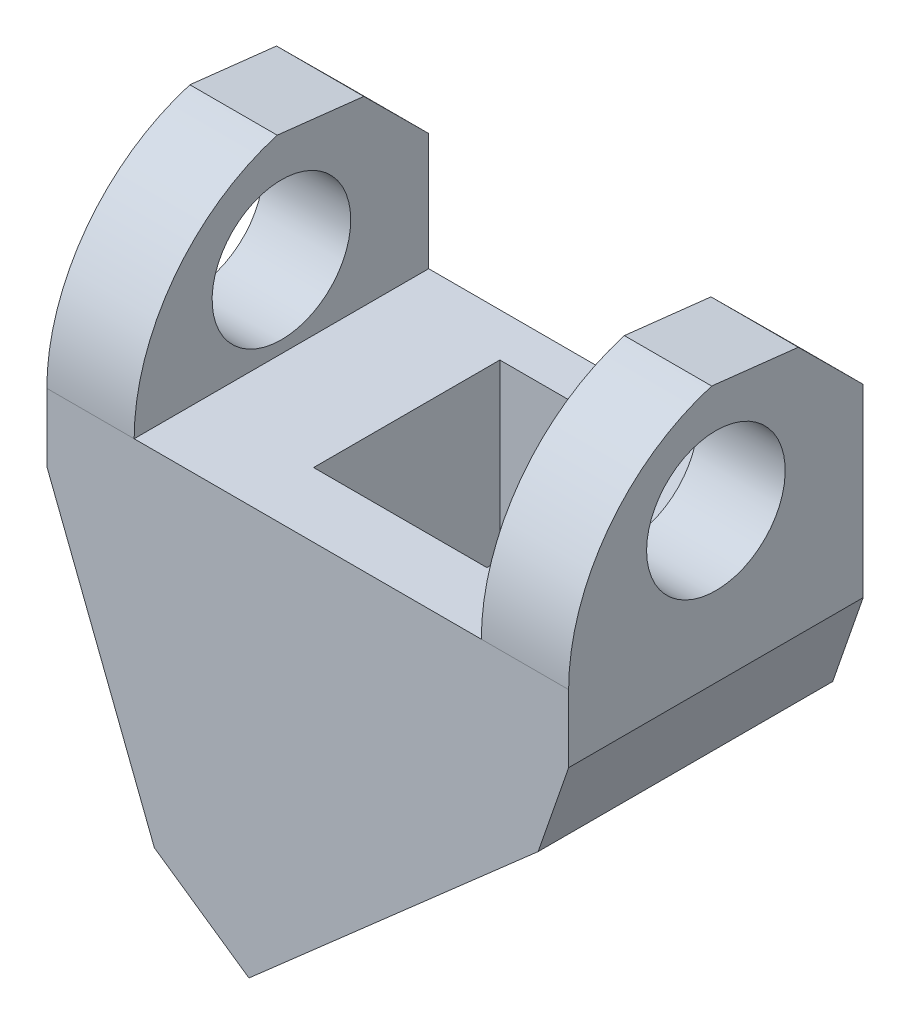
ISO-10303-21;
HEADER;
FILE_DESCRIPTION(('STEP AP214'),'2;1');
FILE_NAME('part.step','',(''),(''),'','','');
FILE_SCHEMA(('AUTOMOTIVE_DESIGN { 1 0 10303 214 1 1 1 1 }'));
ENDSEC;
DATA;
#1=APPLICATION_CONTEXT('core data for automotive mechanical design processes');
#2=APPLICATION_PROTOCOL_DEFINITION('international standard','automotive_design',2000,#1);
#3=PRODUCT_CONTEXT('',#1,'mechanical');
#4=PRODUCT('Part','Part','',(#3));
#5=PRODUCT_RELATED_PRODUCT_CATEGORY('part','',(#4));
#6=PRODUCT_DEFINITION_FORMATION('','',#4);
#7=PRODUCT_DEFINITION_CONTEXT('part definition',#1,'design');
#8=PRODUCT_DEFINITION('design','',#6,#7);
#9=PRODUCT_DEFINITION_SHAPE('','',#8);
#10=(LENGTH_UNIT() NAMED_UNIT(*) SI_UNIT(.MILLI.,.METRE.));
#11=(NAMED_UNIT(*) PLANE_ANGLE_UNIT() SI_UNIT($,.RADIAN.));
#12=(NAMED_UNIT(*) SI_UNIT($,.STERADIAN.) SOLID_ANGLE_UNIT());
#13=UNCERTAINTY_MEASURE_WITH_UNIT(LENGTH_MEASURE(1.E-05),#10,'distance_accuracy_value','');
#14=(GEOMETRIC_REPRESENTATION_CONTEXT(3) GLOBAL_UNCERTAINTY_ASSIGNED_CONTEXT((#13)) GLOBAL_UNIT_ASSIGNED_CONTEXT((#10,
#11,#12)) REPRESENTATION_CONTEXT('',''));
#15=CARTESIAN_POINT('',(0.,0.,0.));
#16=DIRECTION('',(0.,0.,1.));
#17=DIRECTION('',(1.,0.,0.));
#18=AXIS2_PLACEMENT_3D('',#15,#16,#17);
#19=CARTESIAN_POINT('',(-4.8839844465823,-18.3497117213235,17.));
#20=DIRECTION('',(-0.660001667960943,0.751264133503506,0.));
#21=DIRECTION('',(-0.751264133503506,-0.660001667960943,0.));
#22=AXIS2_PLACEMENT_3D('',#19,#20,#21);
#23=PLANE('',#22);
#24=DIRECTION('',(0.751264133503506,0.660001667960943,0.));
#25=VECTOR('',#24,1.);
#26=CARTESIAN_POINT('',(-4.8839844465823,-18.3497117213235,0.));
#27=LINE('',#26,#25);
#28=CARTESIAN_POINT('',(-4.8839844465823,-18.3497117213235,0.));
#29=VERTEX_POINT('',#28);
#30=CARTESIAN_POINT('',(11.8091045998656,-3.68447465923131,0.));
#31=VERTEX_POINT('',#30);
#32=EDGE_CURVE('E302',#29,#31,#27,.T.);
#33=ORIENTED_EDGE('',*,*,#32,.T.);
#34=DIRECTION('',(0.,0.,-1.));
#35=VECTOR('',#34,1.);
#36=CARTESIAN_POINT('',(11.8091045998656,-3.68447465923131,17.));
#37=LINE('',#36,#35);
#38=CARTESIAN_POINT('',(11.8091045998656,-3.68447465923131,17.));
#39=VERTEX_POINT('',#38);
#40=EDGE_CURVE('E323',#39,#31,#37,.T.);
#41=ORIENTED_EDGE('',*,*,#40,.F.);
#42=DIRECTION('',(0.751264133503506,0.660001667960943,0.));
#43=VECTOR('',#42,1.);
#44=CARTESIAN_POINT('',(-4.8839844465823,-18.3497117213235,17.));
#45=LINE('',#44,#43);
#46=CARTESIAN_POINT('',(-4.8839844465823,-18.3497117213235,17.));
#47=VERTEX_POINT('',#46);
#48=EDGE_CURVE('E286',#47,#39,#45,.T.);
#49=ORIENTED_EDGE('',*,*,#48,.F.);
#50=DIRECTION('',(0.,0.,-1.));
#51=VECTOR('',#50,1.);
#52=CARTESIAN_POINT('',(-4.8839844465823,-18.3497117213235,17.));
#53=LINE('',#52,#51);
#54=EDGE_CURVE('E326',#47,#29,#53,.T.);
#55=ORIENTED_EDGE('',*,*,#54,.T.);
#56=EDGE_LOOP('',(#33,#41,#49,#55));
#57=FACE_BOUND('',#56,.T.);
#58=DIRECTION('',(0.751264133503506,0.660001667960943,0.));
#59=VECTOR('',#58,1.);
#60=CARTESIAN_POINT('',(-1.64580865514037,-15.5049047776782,13.26));
#61=LINE('',#60,#59);
#62=CARTESIAN_POINT('',(-1.86390262989822,-15.6965050161205,13.26));
#63=VERTEX_POINT('',#62);
#64=CARTESIAN_POINT('',(5.25056871437998,-9.44628922053035,13.26));
#65=VERTEX_POINT('',#64);
#66=EDGE_CURVE('E218',#63,#65,#61,.T.);
#67=ORIENTED_EDGE('',*,*,#66,.T.);
#68=DIRECTION('',(0.,0.,-1.));
#69=VECTOR('',#68,1.);
#70=CARTESIAN_POINT('',(5.25056871437998,-9.44628922053035,13.26));
#71=LINE('',#70,#69);
#72=CARTESIAN_POINT('',(5.25056871437998,-9.44628922053035,2.51));
#73=VERTEX_POINT('',#72);
#74=EDGE_CURVE('E214',#65,#73,#71,.T.);
#75=ORIENTED_EDGE('',*,*,#74,.T.);
#76=DIRECTION('',(-0.751264133503506,-0.660001667960943,0.));
#77=VECTOR('',#76,1.);
#78=CARTESIAN_POINT('',(-1.64580865514036,-15.5049047776782,2.51));
#79=LINE('',#78,#77);
#80=CARTESIAN_POINT('',(-1.86390262989821,-15.6965050161205,2.51));
#81=VERTEX_POINT('',#80);
#82=EDGE_CURVE('E217',#73,#81,#79,.T.);
#83=ORIENTED_EDGE('',*,*,#82,.T.);
#84=DIRECTION('',(0.,0.,1.));
#85=VECTOR('',#84,1.);
#86=CARTESIAN_POINT('',(-1.86390262989822,-15.6965050161205,13.26));
#87=LINE('',#86,#85);
#88=EDGE_CURVE('E220',#81,#63,#87,.T.);
#89=ORIENTED_EDGE('',*,*,#88,.T.);
#90=EDGE_LOOP('',(#67,#75,#83,#89));
#91=FACE_BOUND('',#90,.T.);
#92=ADVANCED_FACE('F38',(#57,#91),#23,.F.);
#93=CARTESIAN_POINT('',(-16.5501850935069,16.3893514750919,17.));
#94=DIRECTION('',(1.,0.,0.));
#95=DIRECTION('',(0.,0.,-1.));
#96=AXIS2_PLACEMENT_3D('',#93,#94,#95);
#97=PLANE('',#96);
#98=CARTESIAN_POINT('',(-16.5501850935069,9.9893514750919,8.5));
#99=DIRECTION('',(1.,0.,0.));
#100=DIRECTION('',(0.,0.,-1.));
#101=AXIS2_PLACEMENT_3D('',#98,#99,#100);
#102=CIRCLE('',#101,4.);
#103=CARTESIAN_POINT('',(-16.5501850935069,9.9893514750919,4.5));
#104=VERTEX_POINT('',#103);
#105=EDGE_CURVE('E452',#104,#104,#102,.T.);
#106=ORIENTED_EDGE('',*,*,#105,.T.);
#107=EDGE_LOOP('',(#106));
#108=FACE_BOUND('',#107,.T.);
#109=CARTESIAN_POINT('',(-16.5501850935069,5.29235147509189,5.48128734210198));
#110=DIRECTION('',(1.,0.,0.));
#111=DIRECTION('',(0.,0.,-1.));
#112=AXIS2_PLACEMENT_3D('',#109,#110,#111);
#113=CIRCLE('',#112,11.518712657898);
#114=CARTESIAN_POINT('',(-16.5501850935069,16.3393374463655,8.74393078656595));
#115=VERTEX_POINT('',#114);
#116=CARTESIAN_POINT('',(-16.5501850935069,5.2923514750919,17.));
#117=VERTEX_POINT('',#116);
#118=EDGE_CURVE('E267',#115,#117,#113,.T.);
#119=ORIENTED_EDGE('',*,*,#118,.F.);
#120=DIRECTION('',(0.,-0.111815815852001,-0.99372894861997));
#121=VECTOR('',#120,1.);
#122=CARTESIAN_POINT('',(-16.5501850935069,17.257332697187,16.9023334998668));
#123=LINE('',#122,#121);
#124=CARTESIAN_POINT('',(-16.5501850935069,15.7767302283345,3.74393078656595));
#125=VERTEX_POINT('',#124);
#126=EDGE_CURVE('E275',#115,#125,#123,.T.);
#127=ORIENTED_EDGE('',*,*,#126,.T.);
#128=DIRECTION('',(0.,-0.705253158861616,-0.708955557080775));
#129=VECTOR('',#128,1.);
#130=CARTESIAN_POINT('',(-16.5501850935069,22.7093807716266,10.7129759673056));
#131=LINE('',#130,#129);
#132=CARTESIAN_POINT('',(-16.5501850935069,12.0523514750919,0.));
#133=VERTEX_POINT('',#132);
#134=EDGE_CURVE('E258',#125,#133,#131,.T.);
#135=ORIENTED_EDGE('',*,*,#134,.T.);
#136=DIRECTION('',(0.,-1.,0.));
#137=VECTOR('',#136,1.);
#138=CARTESIAN_POINT('',(-16.5501850935069,16.3893514750919,0.));
#139=LINE('',#138,#137);
#140=CARTESIAN_POINT('',(-16.5501850935069,1.3893514750919,0.));
#141=VERTEX_POINT('',#140);
#142=EDGE_CURVE('E278',#133,#141,#139,.T.);
#143=ORIENTED_EDGE('',*,*,#142,.T.);
#144=DIRECTION('',(0.,0.,-1.));
#145=VECTOR('',#144,1.);
#146=CARTESIAN_POINT('',(-16.5501850935069,1.3893514750919,17.));
#147=LINE('',#146,#145);
#148=CARTESIAN_POINT('',(-16.5501850935069,1.3893514750919,17.));
#149=VERTEX_POINT('',#148);
#150=EDGE_CURVE('E332',#149,#141,#147,.T.);
#151=ORIENTED_EDGE('',*,*,#150,.F.);
#152=DIRECTION('',(0.,-1.,0.));
#153=VECTOR('',#152,1.);
#154=CARTESIAN_POINT('',(-16.5501850935069,16.3893514750919,17.));
#155=LINE('',#154,#153);
#156=EDGE_CURVE('E279',#117,#149,#155,.T.);
#157=ORIENTED_EDGE('',*,*,#156,.F.);
#158=EDGE_LOOP('',(#119,#127,#135,#143,#151,#157));
#159=FACE_BOUND('',#158,.T.);
#160=ADVANCED_FACE('F40',(#108,#159),#97,.F.);
#161=CARTESIAN_POINT('',(13.5678508461043,1.3893514750919,17.));
#162=DIRECTION('',(-1.,0.,0.));
#163=DIRECTION('',(0.,0.,1.));
#164=AXIS2_PLACEMENT_3D('',#161,#162,#163);
#165=PLANE('',#164);
#166=CARTESIAN_POINT('',(13.5678508461043,9.9893514750919,8.5));
#167=DIRECTION('',(-1.,0.,0.));
#168=DIRECTION('',(0.,0.,1.));
#169=AXIS2_PLACEMENT_3D('',#166,#167,#168);
#170=CIRCLE('',#169,4.);
#171=CARTESIAN_POINT('',(13.5678508461043,9.9893514750919,12.5));
#172=VERTEX_POINT('',#171);
#173=EDGE_CURVE('E450',#172,#172,#170,.T.);
#174=ORIENTED_EDGE('',*,*,#173,.T.);
#175=EDGE_LOOP('',(#174));
#176=FACE_BOUND('',#175,.T.);
#177=CARTESIAN_POINT('',(13.5678508461043,5.2923514750919,5.48128734210198));
#178=DIRECTION('',(-1.,0.,0.));
#179=DIRECTION('',(0.,0.,1.));
#180=AXIS2_PLACEMENT_3D('',#177,#178,#179);
#181=CIRCLE('',#180,11.518712657898);
#182=CARTESIAN_POINT('',(13.5678508461043,5.29235147509191,17.));
#183=VERTEX_POINT('',#182);
#184=CARTESIAN_POINT('',(13.5678508461043,16.3393374463655,8.74393078656595));
#185=VERTEX_POINT('',#184);
#186=EDGE_CURVE('E265',#183,#185,#181,.T.);
#187=ORIENTED_EDGE('',*,*,#186,.F.);
#188=DIRECTION('',(0.,1.,0.));
#189=VECTOR('',#188,1.);
#190=CARTESIAN_POINT('',(13.5678508461043,1.3893514750919,17.));
#191=LINE('',#190,#189);
#192=CARTESIAN_POINT('',(13.5678508461043,1.3893514750919,17.));
#193=VERTEX_POINT('',#192);
#194=EDGE_CURVE('E290',#193,#183,#191,.T.);
#195=ORIENTED_EDGE('',*,*,#194,.F.);
#196=DIRECTION('',(0.,0.,-1.));
#197=VECTOR('',#196,1.);
#198=CARTESIAN_POINT('',(13.5678508461043,1.3893514750919,17.));
#199=LINE('',#198,#197);
#200=CARTESIAN_POINT('',(13.5678508461043,1.3893514750919,0.));
#201=VERTEX_POINT('',#200);
#202=EDGE_CURVE('E320',#193,#201,#199,.T.);
#203=ORIENTED_EDGE('',*,*,#202,.T.);
#204=DIRECTION('',(0.,1.,0.));
#205=VECTOR('',#204,1.);
#206=CARTESIAN_POINT('',(13.5678508461043,1.3893514750919,0.));
#207=LINE('',#206,#205);
#208=CARTESIAN_POINT('',(13.5678508461043,12.0523514750919,0.));
#209=VERTEX_POINT('',#208);
#210=EDGE_CURVE('E306',#201,#209,#207,.T.);
#211=ORIENTED_EDGE('',*,*,#210,.T.);
#212=DIRECTION('',(0.,0.705253158861616,0.708955557080775));
#213=VECTOR('',#212,1.);
#214=CARTESIAN_POINT('',(13.5678508461043,15.2486505003623,3.21307877544994));
#215=LINE('',#214,#213);
#216=CARTESIAN_POINT('',(13.5678508461043,15.7767302283345,3.74393078656595));
#217=VERTEX_POINT('',#216);
#218=EDGE_CURVE('E255',#209,#217,#215,.T.);
#219=ORIENTED_EDGE('',*,*,#218,.T.);
#220=DIRECTION('',(0.,0.111815815852001,0.99372894861997));
#221=VECTOR('',#220,1.);
#222=CARTESIAN_POINT('',(13.5678508461043,17.0697910470672,15.2356143029814));
#223=LINE('',#222,#221);
#224=EDGE_CURVE('E272',#217,#185,#223,.T.);
#225=ORIENTED_EDGE('',*,*,#224,.T.);
#226=EDGE_LOOP('',(#187,#195,#203,#211,#219,#225));
#227=FACE_BOUND('',#226,.T.);
#228=ADVANCED_FACE('F373',(#176,#227),#165,.F.);
#229=CARTESIAN_POINT('',(8.52785084610433,16.3893514750919,17.));
#230=DIRECTION('',(1.,0.,0.));
#231=DIRECTION('',(0.,1.,0.));
#232=AXIS2_PLACEMENT_3D('',#229,#230,#231);
#233=PLANE('',#232);
#234=CARTESIAN_POINT('',(8.52785084610434,9.9893514750919,8.5));
#235=DIRECTION('',(1.,0.,0.));
#236=DIRECTION('',(0.,1.,0.));
#237=AXIS2_PLACEMENT_3D('',#234,#235,#236);
#238=CIRCLE('',#237,4.);
#239=CARTESIAN_POINT('',(8.52785084610433,13.9893514750919,8.5));
#240=VERTEX_POINT('',#239);
#241=EDGE_CURVE('E453',#240,#240,#238,.T.);
#242=ORIENTED_EDGE('',*,*,#241,.T.);
#243=EDGE_LOOP('',(#242));
#244=FACE_BOUND('',#243,.T.);
#245=CARTESIAN_POINT('',(8.52785084610434,5.2923514750919,5.48128734210198));
#246=DIRECTION('',(1.,0.,0.));
#247=DIRECTION('',(0.,1.,0.));
#248=AXIS2_PLACEMENT_3D('',#245,#246,#247);
#249=CIRCLE('',#248,11.518712657898);
#250=CARTESIAN_POINT('',(8.52785084610433,16.3393374463655,8.74393078656595));
#251=VERTEX_POINT('',#250);
#252=CARTESIAN_POINT('',(8.52785084610434,5.29235147509191,17.));
#253=VERTEX_POINT('',#252);
#254=EDGE_CURVE('E263',#251,#253,#249,.T.);
#255=ORIENTED_EDGE('',*,*,#254,.F.);
#256=DIRECTION('',(0.,-0.111815815852001,-0.99372894861997));
#257=VECTOR('',#256,1.);
#258=CARTESIAN_POINT('',(8.52785084610433,17.257332697187,16.9023334998668));
#259=LINE('',#258,#257);
#260=CARTESIAN_POINT('',(8.52785084610433,15.7767302283345,3.74393078656595));
#261=VERTEX_POINT('',#260);
#262=EDGE_CURVE('E269',#251,#261,#259,.T.);
#263=ORIENTED_EDGE('',*,*,#262,.T.);
#264=DIRECTION('',(0.,-0.705253158861616,-0.708955557080775));
#265=VECTOR('',#264,1.);
#266=CARTESIAN_POINT('',(8.52785084610433,22.7093807716266,10.7129759673056));
#267=LINE('',#266,#265);
#268=CARTESIAN_POINT('',(8.52785084610434,12.0523514750919,0.));
#269=VERTEX_POINT('',#268);
#270=EDGE_CURVE('E252',#261,#269,#267,.T.);
#271=ORIENTED_EDGE('',*,*,#270,.T.);
#272=DIRECTION('',(0.,-1.,0.));
#273=VECTOR('',#272,1.);
#274=CARTESIAN_POINT('',(8.52785084610433,16.3893514750919,0.));
#275=LINE('',#274,#273);
#276=CARTESIAN_POINT('',(8.52785084610434,5.2923514750919,0.));
#277=VERTEX_POINT('',#276);
#278=EDGE_CURVE('E309',#269,#277,#275,.T.);
#279=ORIENTED_EDGE('',*,*,#278,.T.);
#280=DIRECTION('',(0.,0.,-1.));
#281=VECTOR('',#280,1.);
#282=CARTESIAN_POINT('',(8.52785084610434,5.2923514750919,17.));
#283=LINE('',#282,#281);
#284=EDGE_CURVE('E317',#253,#277,#283,.T.);
#285=ORIENTED_EDGE('',*,*,#284,.F.);
#286=EDGE_LOOP('',(#255,#263,#271,#279,#285));
#287=FACE_BOUND('',#286,.T.);
#288=ADVANCED_FACE('F362',(#244,#287),#233,.F.);
#289=CARTESIAN_POINT('',(-11.5101850935069,5.2923514750919,17.));
#290=DIRECTION('',(-1.,0.,0.));
#291=DIRECTION('',(0.,-1.,0.));
#292=AXIS2_PLACEMENT_3D('',#289,#290,#291);
#293=PLANE('',#292);
#294=CARTESIAN_POINT('',(-11.5101850935069,9.9893514750919,8.5));
#295=DIRECTION('',(-1.,0.,0.));
#296=DIRECTION('',(0.,-1.,0.));
#297=AXIS2_PLACEMENT_3D('',#294,#295,#296);
#298=CIRCLE('',#297,4.);
#299=CARTESIAN_POINT('',(-11.5101850935069,5.98935147509189,8.5));
#300=VERTEX_POINT('',#299);
#301=EDGE_CURVE('E42',#300,#300,#298,.T.);
#302=ORIENTED_EDGE('',*,*,#301,.T.);
#303=EDGE_LOOP('',(#302));
#304=FACE_BOUND('',#303,.T.);
#305=CARTESIAN_POINT('',(-11.5101850935069,5.29235147509189,5.48128734210198));
#306=DIRECTION('',(-1.,0.,0.));
#307=DIRECTION('',(0.,-1.,0.));
#308=AXIS2_PLACEMENT_3D('',#305,#306,#307);
#309=CIRCLE('',#308,11.518712657898);
#310=CARTESIAN_POINT('',(-11.5101850935069,5.2923514750919,17.));
#311=VERTEX_POINT('',#310);
#312=CARTESIAN_POINT('',(-11.5101850935069,16.3393374463655,8.74393078656595));
#313=VERTEX_POINT('',#312);
#314=EDGE_CURVE('E261',#311,#313,#309,.T.);
#315=ORIENTED_EDGE('',*,*,#314,.F.);
#316=DIRECTION('',(0.,0.,-1.));
#317=VECTOR('',#316,1.);
#318=CARTESIAN_POINT('',(-11.5101850935069,5.2923514750919,17.));
#319=LINE('',#318,#317);
#320=CARTESIAN_POINT('',(-11.5101850935069,5.2923514750919,0.));
#321=VERTEX_POINT('',#320);
#322=EDGE_CURVE('E296',#311,#321,#319,.T.);
#323=ORIENTED_EDGE('',*,*,#322,.T.);
#324=DIRECTION('',(0.,1.,0.));
#325=VECTOR('',#324,1.);
#326=CARTESIAN_POINT('',(-11.5101850935069,5.2923514750919,0.));
#327=LINE('',#326,#325);
#328=CARTESIAN_POINT('',(-11.5101850935069,12.0523514750919,0.));
#329=VERTEX_POINT('',#328);
#330=EDGE_CURVE('E282',#321,#329,#327,.T.);
#331=ORIENTED_EDGE('',*,*,#330,.T.);
#332=DIRECTION('',(0.,0.705253158861616,0.708955557080775));
#333=VECTOR('',#332,1.);
#334=CARTESIAN_POINT('',(-11.5101850935069,17.1899325169452,5.1645520247708));
#335=LINE('',#334,#333);
#336=CARTESIAN_POINT('',(-11.5101850935069,15.7767302283345,3.74393078656595));
#337=VERTEX_POINT('',#336);
#338=EDGE_CURVE('E249',#329,#337,#335,.T.);
#339=ORIENTED_EDGE('',*,*,#338,.T.);
#340=DIRECTION('',(0.,0.111815815852001,0.99372894861997));
#341=VECTOR('',#340,1.);
#342=CARTESIAN_POINT('',(-11.5101850935069,17.1185893844284,15.669294638011));
#343=LINE('',#342,#341);
#344=EDGE_CURVE('E11',#337,#313,#343,.T.);
#345=ORIENTED_EDGE('',*,*,#344,.T.);
#346=EDGE_LOOP('',(#315,#323,#331,#339,#345));
#347=FACE_BOUND('',#346,.T.);
#348=ADVANCED_FACE('F354',(#304,#347),#293,.F.);
#349=CARTESIAN_POINT('',(0.,0.,17.));
#350=DIRECTION('',(0.,0.,1.));
#351=DIRECTION('',(1.,0.,0.));
#352=AXIS2_PLACEMENT_3D('',#349,#350,#351);
#353=PLANE('',#352);
#354=ORIENTED_EDGE('',*,*,#194,.T.);
#355=DIRECTION('',(-1.,0.,0.));
#356=VECTOR('',#355,1.);
#357=CARTESIAN_POINT('',(32.4898149064931,5.29235147509191,17.));
#358=LINE('',#357,#356);
#359=EDGE_CURVE('E47',#183,#253,#358,.T.);
#360=ORIENTED_EDGE('',*,*,#359,.T.);
#361=DIRECTION('',(-1.,0.,0.));
#362=VECTOR('',#361,1.);
#363=CARTESIAN_POINT('',(8.52785084610434,5.2923514750919,17.));
#364=LINE('',#363,#362);
#365=EDGE_CURVE('E293',#253,#311,#364,.T.);
#366=ORIENTED_EDGE('',*,*,#365,.T.);
#367=EDGE_CURVE('E339',#311,#117,#358,.T.);
#368=ORIENTED_EDGE('',*,*,#367,.T.);
#369=ORIENTED_EDGE('',*,*,#156,.T.);
#370=DIRECTION('',(0.362438038283703,-0.932007869282798,0.));
#371=VECTOR('',#370,1.);
#372=CARTESIAN_POINT('',(-16.5501850935069,1.3893514750919,17.));
#373=LINE('',#372,#371);
#374=CARTESIAN_POINT('',(-10.3436805331332,-14.5706485249081,17.));
#375=VERTEX_POINT('',#374);
#376=EDGE_CURVE('E281',#149,#375,#373,.T.);
#377=ORIENTED_EDGE('',*,*,#376,.T.);
#378=DIRECTION('',(0.822243386528746,-0.569136023556531,0.));
#379=VECTOR('',#378,1.);
#380=CARTESIAN_POINT('',(-10.3436805331332,-14.5706485249081,17.));
#381=LINE('',#380,#379);
#382=EDGE_CURVE('E284',#375,#47,#381,.T.);
#383=ORIENTED_EDGE('',*,*,#382,.T.);
#384=ORIENTED_EDGE('',*,*,#48,.T.);
#385=DIRECTION('',(0.327513267456003,0.944846579948455,0.));
#386=VECTOR('',#385,1.);
#387=CARTESIAN_POINT('',(11.8091045998656,-3.68447465923131,17.));
#388=LINE('',#387,#386);
#389=EDGE_CURVE('E288',#39,#193,#388,.T.);
#390=ORIENTED_EDGE('',*,*,#389,.T.);
#391=EDGE_LOOP('',(#354,#360,#366,#368,#369,#377,#383,#384,#390));
#392=FACE_BOUND('',#391,.T.);
#393=ADVANCED_FACE('F428',(#392),#353,.T.);
#394=CARTESIAN_POINT('',(-16.5501850935069,1.3893514750919,17.));
#395=DIRECTION('',(0.932007869282798,0.362438038283703,0.));
#396=DIRECTION('',(-0.362438038283703,0.932007869282798,0.));
#397=AXIS2_PLACEMENT_3D('',#394,#395,#396);
#398=PLANE('',#397);
#399=DIRECTION('',(0.362438038283703,-0.932007869282798,0.));
#400=VECTOR('',#399,1.);
#401=CARTESIAN_POINT('',(-16.5501850935069,1.3893514750919,0.));
#402=LINE('',#401,#400);
#403=CARTESIAN_POINT('',(-10.3436805331332,-14.5706485249081,0.));
#404=VERTEX_POINT('',#403);
#405=EDGE_CURVE('E298',#141,#404,#402,.T.);
#406=ORIENTED_EDGE('',*,*,#405,.T.);
#407=DIRECTION('',(0.,0.,-1.));
#408=VECTOR('',#407,1.);
#409=CARTESIAN_POINT('',(-10.3436805331332,-14.5706485249081,17.));
#410=LINE('',#409,#408);
#411=EDGE_CURVE('E329',#375,#404,#410,.T.);
#412=ORIENTED_EDGE('',*,*,#411,.F.);
#413=ORIENTED_EDGE('',*,*,#376,.F.);
#414=ORIENTED_EDGE('',*,*,#150,.T.);
#415=EDGE_LOOP('',(#406,#412,#413,#414));
#416=FACE_BOUND('',#415,.T.);
#417=ADVANCED_FACE('F392',(#416),#398,.F.);
#418=CARTESIAN_POINT('',(-10.3436805331332,-14.5706485249081,17.));
#419=DIRECTION('',(0.569136023556531,0.822243386528746,0.));
#420=DIRECTION('',(-0.822243386528746,0.569136023556531,0.));
#421=AXIS2_PLACEMENT_3D('',#418,#419,#420);
#422=PLANE('',#421);
#423=DIRECTION('',(0.822243386528746,-0.569136023556531,0.));
#424=VECTOR('',#423,1.);
#425=CARTESIAN_POINT('',(-10.3436805331332,-14.5706485249081,0.));
#426=LINE('',#425,#424);
#427=EDGE_CURVE('E300',#404,#29,#426,.T.);
#428=ORIENTED_EDGE('',*,*,#427,.T.);
#429=ORIENTED_EDGE('',*,*,#54,.F.);
#430=ORIENTED_EDGE('',*,*,#382,.F.);
#431=ORIENTED_EDGE('',*,*,#411,.T.);
#432=EDGE_LOOP('',(#428,#429,#430,#431));
#433=FACE_BOUND('',#432,.T.);
#434=ADVANCED_FACE('F389',(#433),#422,.F.);
#435=CARTESIAN_POINT('',(11.8091045998656,-3.68447465923131,17.));
#436=DIRECTION('',(-0.944846579948455,0.327513267456003,0.));
#437=DIRECTION('',(-0.327513267456003,-0.944846579948455,0.));
#438=AXIS2_PLACEMENT_3D('',#435,#436,#437);
#439=PLANE('',#438);
#440=DIRECTION('',(0.327513267456003,0.944846579948455,0.));
#441=VECTOR('',#440,1.);
#442=CARTESIAN_POINT('',(11.8091045998656,-3.68447465923131,0.));
#443=LINE('',#442,#441);
#444=EDGE_CURVE('E304',#31,#201,#443,.T.);
#445=ORIENTED_EDGE('',*,*,#444,.T.);
#446=ORIENTED_EDGE('',*,*,#202,.F.);
#447=ORIENTED_EDGE('',*,*,#389,.F.);
#448=ORIENTED_EDGE('',*,*,#40,.T.);
#449=EDGE_LOOP('',(#445,#446,#447,#448));
#450=FACE_BOUND('',#449,.T.);
#451=ADVANCED_FACE('F380',(#450),#439,.F.);
#452=CARTESIAN_POINT('',(8.52785084610434,5.2923514750919,17.));
#453=DIRECTION('',(0.,-1.,0.));
#454=DIRECTION('',(1.,0.,0.));
#455=AXIS2_PLACEMENT_3D('',#452,#453,#454);
#456=PLANE('',#455);
#457=DIRECTION('',(1.,0.,0.));
#458=VECTOR('',#457,1.);
#459=CARTESIAN_POINT('',(-4.89214915389567,5.2923514750919,13.26));
#460=LINE('',#459,#458);
#461=CARTESIAN_POINT('',(-4.89214915389567,5.2923514750919,13.26));
#462=VERTEX_POINT('',#461);
#463=CARTESIAN_POINT('',(5.10785084610433,5.2923514750919,13.26));
#464=VERTEX_POINT('',#463);
#465=EDGE_CURVE('E193',#462,#464,#460,.T.);
#466=ORIENTED_EDGE('',*,*,#465,.F.);
#467=DIRECTION('',(0.,0.,1.));
#468=VECTOR('',#467,1.);
#469=CARTESIAN_POINT('',(-4.89214915389567,5.2923514750919,2.51));
#470=LINE('',#469,#468);
#471=CARTESIAN_POINT('',(-4.89214915389567,5.2923514750919,2.51));
#472=VERTEX_POINT('',#471);
#473=EDGE_CURVE('E54',#472,#462,#470,.T.);
#474=ORIENTED_EDGE('',*,*,#473,.F.);
#475=DIRECTION('',(-1.,0.,0.));
#476=VECTOR('',#475,1.);
#477=CARTESIAN_POINT('',(-4.89214915389567,5.2923514750919,2.51));
#478=LINE('',#477,#476);
#479=CARTESIAN_POINT('',(5.10785084610433,5.2923514750919,2.51));
#480=VERTEX_POINT('',#479);
#481=EDGE_CURVE('E201',#480,#472,#478,.T.);
#482=ORIENTED_EDGE('',*,*,#481,.F.);
#483=DIRECTION('',(0.,0.,-1.));
#484=VECTOR('',#483,1.);
#485=CARTESIAN_POINT('',(5.10785084610433,5.2923514750919,2.51));
#486=LINE('',#485,#484);
#487=EDGE_CURVE('E184',#464,#480,#486,.T.);
#488=ORIENTED_EDGE('',*,*,#487,.F.);
#489=EDGE_LOOP('',(#466,#474,#482,#488));
#490=FACE_BOUND('',#489,.T.);
#491=DIRECTION('',(-1.,0.,0.));
#492=VECTOR('',#491,1.);
#493=CARTESIAN_POINT('',(8.52785084610434,5.2923514750919,0.));
#494=LINE('',#493,#492);
#495=EDGE_CURVE('E311',#277,#321,#494,.T.);
#496=ORIENTED_EDGE('',*,*,#495,.T.);
#497=ORIENTED_EDGE('',*,*,#322,.F.);
#498=ORIENTED_EDGE('',*,*,#365,.F.);
#499=ORIENTED_EDGE('',*,*,#284,.T.);
#500=EDGE_LOOP('',(#496,#497,#498,#499));
#501=FACE_BOUND('',#500,.T.);
#502=ADVANCED_FACE('F198',(#490,#501),#456,.F.);
#503=CARTESIAN_POINT('',(0.,0.,0.));
#504=DIRECTION('',(0.,0.,1.));
#505=DIRECTION('',(1.,0.,0.));
#506=AXIS2_PLACEMENT_3D('',#503,#504,#505);
#507=PLANE('',#506);
#508=ORIENTED_EDGE('',*,*,#142,.F.);
#509=DIRECTION('',(1.,0.,0.));
#510=VECTOR('',#509,1.);
#511=CARTESIAN_POINT('',(0.,12.0523514750919,0.));
#512=LINE('',#511,#510);
#513=EDGE_CURVE('E338',#133,#329,#512,.T.);
#514=ORIENTED_EDGE('',*,*,#513,.T.);
#515=ORIENTED_EDGE('',*,*,#330,.F.);
#516=ORIENTED_EDGE('',*,*,#495,.F.);
#517=ORIENTED_EDGE('',*,*,#278,.F.);
#518=EDGE_CURVE('E335',#269,#209,#512,.T.);
#519=ORIENTED_EDGE('',*,*,#518,.T.);
#520=ORIENTED_EDGE('',*,*,#210,.F.);
#521=ORIENTED_EDGE('',*,*,#444,.F.);
#522=ORIENTED_EDGE('',*,*,#32,.F.);
#523=ORIENTED_EDGE('',*,*,#427,.F.);
#524=ORIENTED_EDGE('',*,*,#405,.F.);
#525=EDGE_LOOP('',(#508,#514,#515,#516,#517,#519,#520,#521,#522,#523,#524));
#526=FACE_BOUND('',#525,.T.);
#527=ADVANCED_FACE('F348',(#526),#507,.F.);
#528=CARTESIAN_POINT('',(32.4898149064931,5.29235147509191,5.48128734210198));
#529=DIRECTION('',(-1.,0.,0.));
#530=DIRECTION('',(0.,-1.,0.));
#531=AXIS2_PLACEMENT_3D('',#528,#529,#530);
#532=CYLINDRICAL_SURFACE('',#531,11.518712657898);
#533=ORIENTED_EDGE('',*,*,#186,.T.);
#534=DIRECTION('',(-1.,0.,0.));
#535=VECTOR('',#534,1.);
#536=CARTESIAN_POINT('',(32.4898149064931,16.3393374463655,8.74393078656595));
#537=LINE('',#536,#535);
#538=EDGE_CURVE('E248',#185,#251,#537,.T.);
#539=ORIENTED_EDGE('',*,*,#538,.T.);
#540=ORIENTED_EDGE('',*,*,#254,.T.);
#541=ORIENTED_EDGE('',*,*,#359,.F.);
#542=EDGE_LOOP('',(#533,#539,#540,#541));
#543=FACE_BOUND('',#542,.T.);
#544=ADVANCED_FACE('F406',(#543),#532,.T.);
#545=CARTESIAN_POINT('',(32.4898149064931,6.05772857574955,-6.02609313221997));
#546=DIRECTION('',(0.,-0.708955557080775,0.705253158861616));
#547=DIRECTION('',(0.,-0.705253158861616,-0.708955557080775));
#548=AXIS2_PLACEMENT_3D('',#545,#546,#547);
#549=PLANE('',#548);
#550=ORIENTED_EDGE('',*,*,#518,.F.);
#551=ORIENTED_EDGE('',*,*,#270,.F.);
#552=DIRECTION('',(-1.,0.,0.));
#553=VECTOR('',#552,1.);
#554=CARTESIAN_POINT('',(32.4898149064931,15.7767302283345,3.74393078656595));
#555=LINE('',#554,#553);
#556=EDGE_CURVE('E244',#217,#261,#555,.T.);
#557=ORIENTED_EDGE('',*,*,#556,.F.);
#558=ORIENTED_EDGE('',*,*,#218,.F.);
#559=EDGE_LOOP('',(#550,#551,#557,#558));
#560=FACE_BOUND('',#559,.T.);
#561=ADVANCED_FACE('F366',(#560),#549,.F.);
#562=CARTESIAN_POINT('',(32.4898149064931,15.1634718727148,-1.70621574520004));
#563=DIRECTION('',(0.,-0.99372894861997,0.111815815852001));
#564=DIRECTION('',(0.,-0.111815815852001,-0.99372894861997));
#565=AXIS2_PLACEMENT_3D('',#562,#563,#564);
#566=PLANE('',#565);
#567=ORIENTED_EDGE('',*,*,#556,.T.);
#568=ORIENTED_EDGE('',*,*,#262,.F.);
#569=ORIENTED_EDGE('',*,*,#538,.F.);
#570=ORIENTED_EDGE('',*,*,#224,.F.);
#571=EDGE_LOOP('',(#567,#568,#569,#570));
#572=FACE_BOUND('',#571,.T.);
#573=ADVANCED_FACE('F368',(#572),#566,.F.);
#574=EDGE_CURVE('E245',#313,#115,#537,.T.);
#575=ORIENTED_EDGE('',*,*,#574,.F.);
#576=ORIENTED_EDGE('',*,*,#344,.F.);
#577=EDGE_CURVE('E223',#337,#125,#555,.T.);
#578=ORIENTED_EDGE('',*,*,#577,.T.);
#579=ORIENTED_EDGE('',*,*,#126,.F.);
#580=EDGE_LOOP('',(#575,#576,#578,#579));
#581=FACE_BOUND('',#580,.T.);
#582=ADVANCED_FACE('F401',(#581),#566,.F.);
#583=ORIENTED_EDGE('',*,*,#118,.T.);
#584=ORIENTED_EDGE('',*,*,#367,.F.);
#585=ORIENTED_EDGE('',*,*,#314,.T.);
#586=ORIENTED_EDGE('',*,*,#574,.T.);
#587=EDGE_LOOP('',(#583,#584,#585,#586));
#588=FACE_BOUND('',#587,.T.);
#589=ADVANCED_FACE('F403',(#588),#532,.T.);
#590=ORIENTED_EDGE('',*,*,#577,.F.);
#591=ORIENTED_EDGE('',*,*,#338,.F.);
#592=ORIENTED_EDGE('',*,*,#513,.F.);
#593=ORIENTED_EDGE('',*,*,#134,.F.);
#594=EDGE_LOOP('',(#590,#591,#592,#593));
#595=FACE_BOUND('',#594,.T.);
#596=ADVANCED_FACE('F398',(#595),#549,.F.);
#597=CARTESIAN_POINT('',(-1.69947934301186,-2.40582043173169,0.));
#598=DIRECTION('',(0.660001667960943,-0.751264133503506,0.));
#599=DIRECTION('',(0.751264133503506,0.660001667960943,0.));
#600=AXIS2_PLACEMENT_3D('',#597,#598,#599);
#601=PLANE('',#600);
#602=DIRECTION('',(0.,0.,-1.));
#603=VECTOR('',#602,1.);
#604=CARTESIAN_POINT('',(-4.89214915389567,-5.21064939462271,0.));
#605=LINE('',#604,#603);
#606=CARTESIAN_POINT('',(-4.89214915389567,-5.21064939462271,13.26));
#607=VERTEX_POINT('',#606);
#608=CARTESIAN_POINT('',(-4.89214915389567,-5.21064939462272,2.51));
#609=VERTEX_POINT('',#608);
#610=EDGE_CURVE('E208',#607,#609,#605,.T.);
#611=ORIENTED_EDGE('',*,*,#610,.F.);
#612=DIRECTION('',(-0.751264133503506,-0.660001667960943,0.));
#613=VECTOR('',#612,1.);
#614=CARTESIAN_POINT('',(-10.5343475708952,-10.1674418197051,13.26));
#615=LINE('',#614,#613);
#616=CARTESIAN_POINT('',(-10.5343475708952,-10.1674418197051,13.26));
#617=VERTEX_POINT('',#616);
#618=EDGE_CURVE('E235',#607,#617,#615,.T.);
#619=ORIENTED_EDGE('',*,*,#618,.T.);
#620=DIRECTION('',(0.,0.,-1.));
#621=VECTOR('',#620,1.);
#622=CARTESIAN_POINT('',(-10.5343475708952,-10.1674418197051,13.26));
#623=LINE('',#622,#621);
#624=CARTESIAN_POINT('',(-10.5343475708952,-10.1674418197051,2.51));
#625=VERTEX_POINT('',#624);
#626=EDGE_CURVE('E224',#617,#625,#623,.T.);
#627=ORIENTED_EDGE('',*,*,#626,.T.);
#628=DIRECTION('',(0.751264133503506,0.660001667960943,0.));
#629=VECTOR('',#628,1.);
#630=CARTESIAN_POINT('',(-10.5343475708952,-10.1674418197051,2.51));
#631=LINE('',#630,#629);
#632=EDGE_CURVE('E227',#625,#609,#631,.T.);
#633=ORIENTED_EDGE('',*,*,#632,.T.);
#634=EDGE_LOOP('',(#611,#619,#627,#633));
#635=FACE_BOUND('',#634,.T.);
#636=ADVANCED_FACE('F411',(#635),#601,.T.);
#637=CARTESIAN_POINT('',(-0.985228383135334,-16.2568275223443,13.26));
#638=DIRECTION('',(0.,0.,-1.));
#639=DIRECTION('',(-1.,0.,0.));
#640=AXIS2_PLACEMENT_3D('',#637,#638,#639);
#641=PLANE('',#640);
#642=ORIENTED_EDGE('',*,*,#618,.F.);
#643=DIRECTION('',(0.,1.,0.));
#644=VECTOR('',#643,1.);
#645=CARTESIAN_POINT('',(-4.89214915389567,-33.0015171880188,13.26));
#646=LINE('',#645,#644);
#647=EDGE_CURVE('E190',#607,#462,#646,.T.);
#648=ORIENTED_EDGE('',*,*,#647,.T.);
#649=ORIENTED_EDGE('',*,*,#465,.T.);
#650=DIRECTION('',(0.,1.,0.));
#651=VECTOR('',#650,1.);
#652=CARTESIAN_POINT('',(5.10785084610433,-33.0015171880188,13.26));
#653=LINE('',#652,#651);
#654=CARTESIAN_POINT('',(5.10785084610433,-9.35527934522134,13.26));
#655=VERTEX_POINT('',#654);
#656=EDGE_CURVE('E62',#655,#464,#653,.T.);
#657=ORIENTED_EDGE('',*,*,#656,.F.);
#658=DIRECTION('',(-0.843154258982509,0.537671735875763,0.));
#659=VECTOR('',#658,1.);
#660=CARTESIAN_POINT('',(6.12924296114287,-10.0066117267541,13.26));
#661=LINE('',#660,#659);
#662=EDGE_CURVE('E228',#65,#655,#661,.T.);
#663=ORIENTED_EDGE('',*,*,#662,.F.);
#664=ORIENTED_EDGE('',*,*,#66,.F.);
#665=DIRECTION('',(-0.843154258982509,0.537671735875763,0.));
#666=VECTOR('',#665,1.);
#667=CARTESIAN_POINT('',(-0.985228383135334,-16.2568275223443,13.26));
#668=LINE('',#667,#666);
#669=EDGE_CURVE('E213',#63,#617,#668,.T.);
#670=ORIENTED_EDGE('',*,*,#669,.T.);
#671=EDGE_LOOP('',(#642,#648,#649,#657,#663,#664,#670));
#672=FACE_BOUND('',#671,.T.);
#673=ADVANCED_FACE('F195',(#672),#641,.T.);
#674=CARTESIAN_POINT('',(6.12924296114287,-10.0066117267541,13.26));
#675=DIRECTION('',(-0.537671735875763,-0.843154258982509,0.));
#676=DIRECTION('',(0.843154258982509,-0.537671735875763,0.));
#677=AXIS2_PLACEMENT_3D('',#674,#675,#676);
#678=PLANE('',#677);
#679=DIRECTION('',(0.,0.,1.));
#680=VECTOR('',#679,1.);
#681=CARTESIAN_POINT('',(5.10785084610433,-9.35527934522134,13.26));
#682=LINE('',#681,#680);
#683=CARTESIAN_POINT('',(5.10785084610433,-9.35527934522134,2.51));
#684=VERTEX_POINT('',#683);
#685=EDGE_CURVE('E187',#684,#655,#682,.T.);
#686=ORIENTED_EDGE('',*,*,#685,.F.);
#687=DIRECTION('',(-0.843154258982509,0.537671735875763,0.));
#688=VECTOR('',#687,1.);
#689=CARTESIAN_POINT('',(6.12924296114287,-10.0066117267541,2.51));
#690=LINE('',#689,#688);
#691=EDGE_CURVE('E231',#73,#684,#690,.T.);
#692=ORIENTED_EDGE('',*,*,#691,.F.);
#693=ORIENTED_EDGE('',*,*,#74,.F.);
#694=ORIENTED_EDGE('',*,*,#662,.T.);
#695=EDGE_LOOP('',(#686,#692,#693,#694));
#696=FACE_BOUND('',#695,.T.);
#697=ADVANCED_FACE('F486',(#696),#678,.T.);
#698=CARTESIAN_POINT('',(-0.985228383135332,-16.2568275223443,2.51));
#699=DIRECTION('',(0.,0.,1.));
#700=DIRECTION('',(1.,0.,0.));
#701=AXIS2_PLACEMENT_3D('',#698,#699,#700);
#702=PLANE('',#701);
#703=ORIENTED_EDGE('',*,*,#691,.T.);
#704=DIRECTION('',(0.,1.,0.));
#705=VECTOR('',#704,1.);
#706=CARTESIAN_POINT('',(5.10785084610433,-33.0015171880188,2.51));
#707=LINE('',#706,#705);
#708=EDGE_CURVE('E189',#684,#480,#707,.T.);
#709=ORIENTED_EDGE('',*,*,#708,.T.);
#710=ORIENTED_EDGE('',*,*,#481,.T.);
#711=DIRECTION('',(0.,1.,0.));
#712=VECTOR('',#711,1.);
#713=CARTESIAN_POINT('',(-4.89214915389567,-33.0015171880188,2.51));
#714=LINE('',#713,#712);
#715=EDGE_CURVE('E206',#609,#472,#714,.T.);
#716=ORIENTED_EDGE('',*,*,#715,.F.);
#717=ORIENTED_EDGE('',*,*,#632,.F.);
#718=DIRECTION('',(-0.843154258982509,0.537671735875763,0.));
#719=VECTOR('',#718,1.);
#720=CARTESIAN_POINT('',(-0.985228383135332,-16.2568275223443,2.51));
#721=LINE('',#720,#719);
#722=EDGE_CURVE('E229',#81,#625,#721,.T.);
#723=ORIENTED_EDGE('',*,*,#722,.F.);
#724=ORIENTED_EDGE('',*,*,#82,.F.);
#725=EDGE_LOOP('',(#703,#709,#710,#716,#717,#723,#724));
#726=FACE_BOUND('',#725,.T.);
#727=ADVANCED_FACE('F482',(#726),#702,.T.);
#728=CARTESIAN_POINT('',(-0.985228383135334,-16.2568275223443,13.26));
#729=DIRECTION('',(0.537671735875763,0.843154258982509,0.));
#730=DIRECTION('',(-0.843154258982509,0.537671735875763,0.));
#731=AXIS2_PLACEMENT_3D('',#728,#729,#730);
#732=PLANE('',#731);
#733=ORIENTED_EDGE('',*,*,#626,.F.);
#734=ORIENTED_EDGE('',*,*,#669,.F.);
#735=ORIENTED_EDGE('',*,*,#88,.F.);
#736=ORIENTED_EDGE('',*,*,#722,.T.);
#737=EDGE_LOOP('',(#733,#734,#735,#736));
#738=FACE_BOUND('',#737,.T.);
#739=ADVANCED_FACE('F479',(#738),#732,.T.);
#740=CARTESIAN_POINT('',(-4.89214915389567,-33.0015171880188,2.51));
#741=DIRECTION('',(-1.,0.,0.));
#742=DIRECTION('',(0.,-1.,0.));
#743=AXIS2_PLACEMENT_3D('',#740,#741,#742);
#744=PLANE('',#743);
#745=ORIENTED_EDGE('',*,*,#610,.T.);
#746=ORIENTED_EDGE('',*,*,#715,.T.);
#747=ORIENTED_EDGE('',*,*,#473,.T.);
#748=ORIENTED_EDGE('',*,*,#647,.F.);
#749=EDGE_LOOP('',(#745,#746,#747,#748));
#750=FACE_BOUND('',#749,.T.);
#751=ADVANCED_FACE('F474',(#750),#744,.F.);
#752=CARTESIAN_POINT('',(5.10785084610433,-33.0015171880188,2.51));
#753=DIRECTION('',(1.,0.,0.));
#754=DIRECTION('',(0.,0.,-1.));
#755=AXIS2_PLACEMENT_3D('',#752,#753,#754);
#756=PLANE('',#755);
#757=ORIENTED_EDGE('',*,*,#685,.T.);
#758=ORIENTED_EDGE('',*,*,#656,.T.);
#759=ORIENTED_EDGE('',*,*,#487,.T.);
#760=ORIENTED_EDGE('',*,*,#708,.F.);
#761=EDGE_LOOP('',(#757,#758,#759,#760));
#762=FACE_BOUND('',#761,.T.);
#763=ADVANCED_FACE('F182',(#762),#756,.F.);
#764=CARTESIAN_POINT('',(-21.4911671237013,9.98935147509189,8.5));
#765=DIRECTION('',(1.,0.,0.));
#766=DIRECTION('',(0.,1.,0.));
#767=AXIS2_PLACEMENT_3D('',#764,#765,#766);
#768=CYLINDRICAL_SURFACE('',#767,4.);
#769=ORIENTED_EDGE('',*,*,#301,.F.);
#770=EDGE_LOOP('',(#769));
#771=FACE_BOUND('',#770,.T.);
#772=ORIENTED_EDGE('',*,*,#105,.F.);
#773=EDGE_LOOP('',(#772));
#774=FACE_BOUND('',#773,.T.);
#775=ADVANCED_FACE('F463',(#771,#774),#768,.F.);
#776=ORIENTED_EDGE('',*,*,#241,.F.);
#777=EDGE_LOOP('',(#776));
#778=FACE_BOUND('',#777,.T.);
#779=ORIENTED_EDGE('',*,*,#173,.F.);
#780=EDGE_LOOP('',(#779));
#781=FACE_BOUND('',#780,.T.);
#782=ADVANCED_FACE('F466',(#778,#781),#768,.F.);
#783=CLOSED_SHELL('',(#92,#160,#228,#288,#348,#393,#417,#434,#451,#502,#527,#544,#561,#573,#582,
#589,#596,#636,#673,#697,#727,#739,#751,#763,#775,#782));
#784=MANIFOLD_SOLID_BREP('B2',#783);
#785=ADVANCED_BREP_SHAPE_REPRESENTATION('',(#18,#784),#14);
#786=SHAPE_DEFINITION_REPRESENTATION(#9,#785);
ENDSEC;
END-ISO-10303-21;
